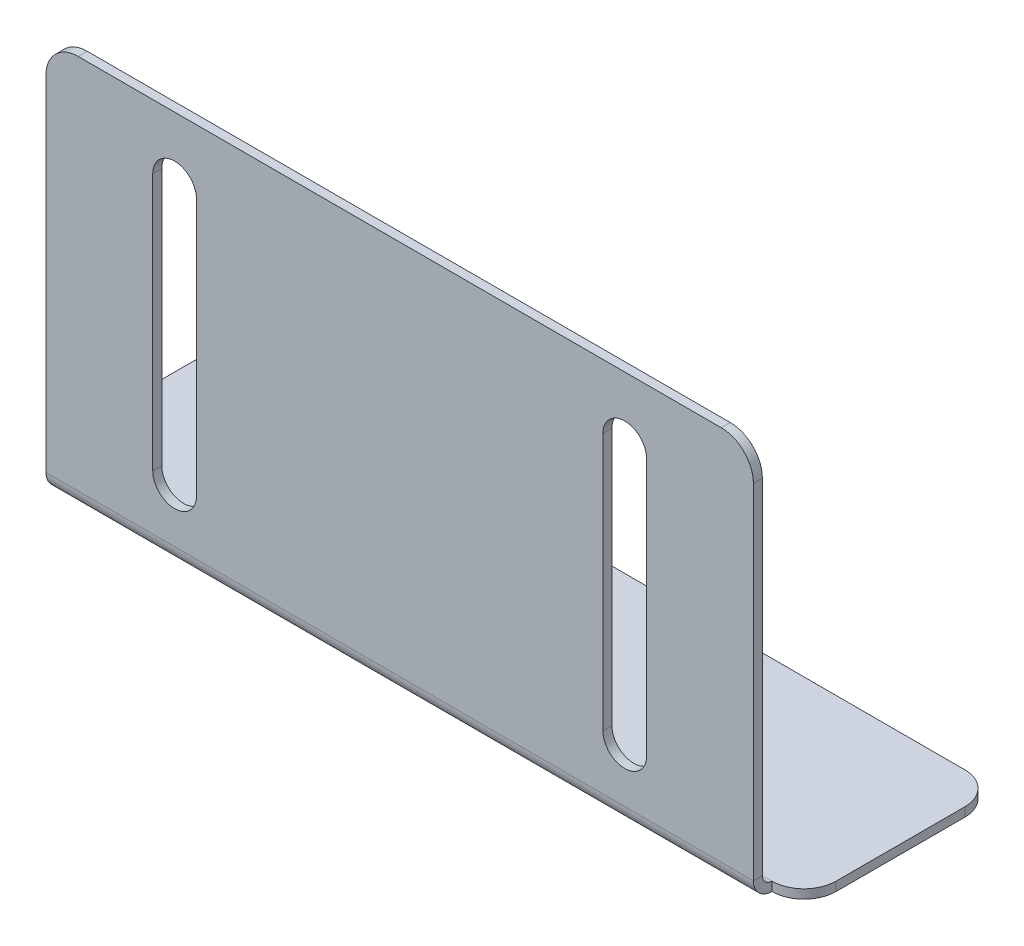
ISO-10303-21;
HEADER;
FILE_DESCRIPTION(('STEP AP214'),'2;1');
FILE_NAME('part.step','',(''),(''),'','','');
FILE_SCHEMA(('AUTOMOTIVE_DESIGN { 1 0 10303 214 1 1 1 1 }'));
ENDSEC;
DATA;
#1=APPLICATION_CONTEXT('core data for automotive mechanical design processes');
#2=APPLICATION_PROTOCOL_DEFINITION('international standard','automotive_design',2000,#1);
#3=PRODUCT_CONTEXT('',#1,'mechanical');
#4=PRODUCT('Part','Part','',(#3));
#5=PRODUCT_RELATED_PRODUCT_CATEGORY('part','',(#4));
#6=PRODUCT_DEFINITION_FORMATION('','',#4);
#7=PRODUCT_DEFINITION_CONTEXT('part definition',#1,'design');
#8=PRODUCT_DEFINITION('design','',#6,#7);
#9=PRODUCT_DEFINITION_SHAPE('','',#8);
#10=(LENGTH_UNIT() NAMED_UNIT(*) SI_UNIT(.MILLI.,.METRE.));
#11=(NAMED_UNIT(*) PLANE_ANGLE_UNIT() SI_UNIT($,.RADIAN.));
#12=(NAMED_UNIT(*) SI_UNIT($,.STERADIAN.) SOLID_ANGLE_UNIT());
#13=UNCERTAINTY_MEASURE_WITH_UNIT(LENGTH_MEASURE(1.E-05),#10,'distance_accuracy_value','');
#14=(GEOMETRIC_REPRESENTATION_CONTEXT(3) GLOBAL_UNCERTAINTY_ASSIGNED_CONTEXT((#13)) GLOBAL_UNIT_ASSIGNED_CONTEXT((#10,
#11,#12)) REPRESENTATION_CONTEXT('',''));
#15=CARTESIAN_POINT('',(0.,0.,0.));
#16=DIRECTION('',(0.,0.,1.));
#17=DIRECTION('',(1.,0.,0.));
#18=AXIS2_PLACEMENT_3D('',#15,#16,#17);
#19=CARTESIAN_POINT('',(-30.,-0.7,7.5));
#20=DIRECTION('',(0.,0.,1.));
#21=DIRECTION('',(1.,0.,0.));
#22=AXIS2_PLACEMENT_3D('',#19,#20,#21);
#23=PLANE('',#22);
#24=DIRECTION('',(1.,0.,0.));
#25=VECTOR('',#24,1.);
#26=CARTESIAN_POINT('',(-30.,-0.7,7.5));
#27=LINE('',#26,#25);
#28=CARTESIAN_POINT('',(27.5,-0.7,7.5));
#29=VERTEX_POINT('',#28);
#30=CARTESIAN_POINT('',(27.501,-0.7,7.5));
#31=VERTEX_POINT('',#30);
#32=EDGE_CURVE('E361',#29,#31,#27,.T.);
#33=ORIENTED_EDGE('',*,*,#32,.T.);
#34=DIRECTION('',(0.,1.,0.));
#35=VECTOR('',#34,1.);
#36=CARTESIAN_POINT('',(27.501,-0.7,7.5));
#37=LINE('',#36,#35);
#38=CARTESIAN_POINT('',(27.501,0.,7.5));
#39=VERTEX_POINT('',#38);
#40=EDGE_CURVE('E342',#31,#39,#37,.T.);
#41=ORIENTED_EDGE('',*,*,#40,.T.);
#42=DIRECTION('',(1.,0.,0.));
#43=VECTOR('',#42,1.);
#44=CARTESIAN_POINT('',(-30.,0.,7.5));
#45=LINE('',#44,#43);
#46=CARTESIAN_POINT('',(27.5,0.,7.5));
#47=VERTEX_POINT('',#46);
#48=EDGE_CURVE('E351',#47,#39,#45,.T.);
#49=ORIENTED_EDGE('',*,*,#48,.F.);
#50=DIRECTION('',(0.,-1.,0.));
#51=VECTOR('',#50,1.);
#52=CARTESIAN_POINT('',(27.5,0.,7.5));
#53=LINE('',#52,#51);
#54=EDGE_CURVE('E309',#47,#29,#53,.T.);
#55=ORIENTED_EDGE('',*,*,#54,.T.);
#56=EDGE_LOOP('',(#33,#41,#49,#55));
#57=FACE_BOUND('',#56,.T.);
#58=ADVANCED_FACE('F54',(#57),#23,.T.);
#59=CARTESIAN_POINT('',(30.,-0.7,-7.5));
#60=DIRECTION('',(1.,0.,0.));
#61=DIRECTION('',(0.,0.,-1.));
#62=AXIS2_PLACEMENT_3D('',#59,#60,#61);
#63=PLANE('',#62);
#64=DIRECTION('',(0.,0.,-1.));
#65=VECTOR('',#64,1.);
#66=CARTESIAN_POINT('',(30.,0.,-7.5));
#67=LINE('',#66,#65);
#68=CARTESIAN_POINT('',(30.,0.,5.001));
#69=VERTEX_POINT('',#68);
#70=CARTESIAN_POINT('',(30.,0.,-5.001));
#71=VERTEX_POINT('',#70);
#72=EDGE_CURVE('E308',#69,#71,#67,.T.);
#73=ORIENTED_EDGE('',*,*,#72,.F.);
#74=DIRECTION('',(0.,1.,0.));
#75=VECTOR('',#74,1.);
#76=CARTESIAN_POINT('',(30.,-0.7,5.001));
#77=LINE('',#76,#75);
#78=CARTESIAN_POINT('',(30.,-0.7,5.001));
#79=VERTEX_POINT('',#78);
#80=EDGE_CURVE('E375',#69,#79,#77,.F.);
#81=ORIENTED_EDGE('',*,*,#80,.T.);
#82=DIRECTION('',(0.,0.,-1.));
#83=VECTOR('',#82,1.);
#84=CARTESIAN_POINT('',(30.,-0.7,-7.5));
#85=LINE('',#84,#83);
#86=CARTESIAN_POINT('',(30.,-0.7,-5.001));
#87=VERTEX_POINT('',#86);
#88=EDGE_CURVE('E350',#79,#87,#85,.T.);
#89=ORIENTED_EDGE('',*,*,#88,.T.);
#90=DIRECTION('',(0.,1.,0.));
#91=VECTOR('',#90,1.);
#92=CARTESIAN_POINT('',(30.,-0.7,-5.001));
#93=LINE('',#92,#91);
#94=EDGE_CURVE('E480',#87,#71,#93,.T.);
#95=ORIENTED_EDGE('',*,*,#94,.T.);
#96=EDGE_LOOP('',(#73,#81,#89,#95));
#97=FACE_BOUND('',#96,.T.);
#98=ADVANCED_FACE('F477',(#97),#63,.T.);
#99=CARTESIAN_POINT('',(-27.501,0.,7.5));
#100=VERTEX_POINT('',#99);
#101=CARTESIAN_POINT('',(-27.5,0.,7.5));
#102=VERTEX_POINT('',#101);
#103=EDGE_CURVE('E347',#100,#102,#45,.T.);
#104=ORIENTED_EDGE('',*,*,#103,.F.);
#105=DIRECTION('',(0.,1.,0.));
#106=VECTOR('',#105,1.);
#107=CARTESIAN_POINT('',(-27.501,-0.7,7.5));
#108=LINE('',#107,#106);
#109=CARTESIAN_POINT('',(-27.501,-0.7,7.5));
#110=VERTEX_POINT('',#109);
#111=EDGE_CURVE('E390',#100,#110,#108,.F.);
#112=ORIENTED_EDGE('',*,*,#111,.T.);
#113=CARTESIAN_POINT('',(-27.5,-0.700000000000001,7.5));
#114=VERTEX_POINT('',#113);
#115=EDGE_CURVE('E346',#110,#114,#27,.T.);
#116=ORIENTED_EDGE('',*,*,#115,.T.);
#117=DIRECTION('',(0.,-1.,0.));
#118=VECTOR('',#117,1.);
#119=CARTESIAN_POINT('',(-27.5,0.,7.5));
#120=LINE('',#119,#118);
#121=EDGE_CURVE('E304',#102,#114,#120,.T.);
#122=ORIENTED_EDGE('',*,*,#121,.F.);
#123=EDGE_LOOP('',(#104,#112,#116,#122));
#124=FACE_BOUND('',#123,.T.);
#125=ADVANCED_FACE('F446',(#124),#23,.T.);
#126=CARTESIAN_POINT('',(-30.,-0.7,-7.5));
#127=DIRECTION('',(-1.,0.,0.));
#128=DIRECTION('',(0.,0.,1.));
#129=AXIS2_PLACEMENT_3D('',#126,#127,#128);
#130=PLANE('',#129);
#131=DIRECTION('',(0.,0.,1.));
#132=VECTOR('',#131,1.);
#133=CARTESIAN_POINT('',(-30.,-0.7,-7.5));
#134=LINE('',#133,#132);
#135=CARTESIAN_POINT('',(-30.,-0.7,-5.001));
#136=VERTEX_POINT('',#135);
#137=CARTESIAN_POINT('',(-30.,-0.7,5.001));
#138=VERTEX_POINT('',#137);
#139=EDGE_CURVE('E365',#136,#138,#134,.T.);
#140=ORIENTED_EDGE('',*,*,#139,.T.);
#141=DIRECTION('',(0.,1.,0.));
#142=VECTOR('',#141,1.);
#143=CARTESIAN_POINT('',(-30.,-0.7,5.001));
#144=LINE('',#143,#142);
#145=CARTESIAN_POINT('',(-30.,0.,5.001));
#146=VERTEX_POINT('',#145);
#147=EDGE_CURVE('E387',#138,#146,#144,.T.);
#148=ORIENTED_EDGE('',*,*,#147,.T.);
#149=DIRECTION('',(0.,0.,1.));
#150=VECTOR('',#149,1.);
#151=CARTESIAN_POINT('',(-30.,0.,-7.5));
#152=LINE('',#151,#150);
#153=CARTESIAN_POINT('',(-30.,0.,-5.001));
#154=VERTEX_POINT('',#153);
#155=EDGE_CURVE('E356',#154,#146,#152,.T.);
#156=ORIENTED_EDGE('',*,*,#155,.F.);
#157=DIRECTION('',(0.,1.,0.));
#158=VECTOR('',#157,1.);
#159=CARTESIAN_POINT('',(-30.,-0.7,-5.001));
#160=LINE('',#159,#158);
#161=EDGE_CURVE('E385',#154,#136,#160,.F.);
#162=ORIENTED_EDGE('',*,*,#161,.T.);
#163=EDGE_LOOP('',(#140,#148,#156,#162));
#164=FACE_BOUND('',#163,.T.);
#165=ADVANCED_FACE('F463',(#164),#130,.T.);
#166=CARTESIAN_POINT('',(-30.,-0.7,-7.5));
#167=DIRECTION('',(0.,0.,-1.));
#168=DIRECTION('',(-1.,0.,0.));
#169=AXIS2_PLACEMENT_3D('',#166,#167,#168);
#170=PLANE('',#169);
#171=DIRECTION('',(-1.,0.,0.));
#172=VECTOR('',#171,1.);
#173=CARTESIAN_POINT('',(-30.,-0.7,-7.5));
#174=LINE('',#173,#172);
#175=CARTESIAN_POINT('',(27.501,-0.7,-7.5));
#176=VERTEX_POINT('',#175);
#177=CARTESIAN_POINT('',(-27.501,-0.7,-7.5));
#178=VERTEX_POINT('',#177);
#179=EDGE_CURVE('E832',#176,#178,#174,.T.);
#180=ORIENTED_EDGE('',*,*,#179,.T.);
#181=DIRECTION('',(0.,1.,0.));
#182=VECTOR('',#181,1.);
#183=CARTESIAN_POINT('',(-27.501,-0.7,-7.5));
#184=LINE('',#183,#182);
#185=CARTESIAN_POINT('',(-27.501,0.,-7.5));
#186=VERTEX_POINT('',#185);
#187=EDGE_CURVE('E394',#178,#186,#184,.T.);
#188=ORIENTED_EDGE('',*,*,#187,.T.);
#189=DIRECTION('',(-1.,0.,0.));
#190=VECTOR('',#189,1.);
#191=CARTESIAN_POINT('',(-30.,0.,-7.5));
#192=LINE('',#191,#190);
#193=CARTESIAN_POINT('',(27.501,0.,-7.5));
#194=VERTEX_POINT('',#193);
#195=EDGE_CURVE('E469',#194,#186,#192,.T.);
#196=ORIENTED_EDGE('',*,*,#195,.F.);
#197=DIRECTION('',(0.,1.,0.));
#198=VECTOR('',#197,1.);
#199=CARTESIAN_POINT('',(27.501,-0.7,-7.5));
#200=LINE('',#199,#198);
#201=EDGE_CURVE('E392',#194,#176,#200,.F.);
#202=ORIENTED_EDGE('',*,*,#201,.T.);
#203=EDGE_LOOP('',(#180,#188,#196,#202));
#204=FACE_BOUND('',#203,.T.);
#205=ADVANCED_FACE('F522',(#204),#170,.T.);
#206=CARTESIAN_POINT('',(0.,-0.7,0.));
#207=DIRECTION('',(0.,1.,0.));
#208=DIRECTION('',(0.,0.,1.));
#209=AXIS2_PLACEMENT_3D('',#206,#207,#208);
#210=PLANE('',#209);
#211=ORIENTED_EDGE('',*,*,#88,.F.);
#212=CARTESIAN_POINT('',(27.501,-0.7,5.001));
#213=DIRECTION('',(0.,1.,0.));
#214=DIRECTION('',(0.,0.,1.));
#215=AXIS2_PLACEMENT_3D('',#212,#213,#214);
#216=CIRCLE('',#215,2.499);
#217=EDGE_CURVE('E383',#79,#31,#216,.F.);
#218=ORIENTED_EDGE('',*,*,#217,.T.);
#219=ORIENTED_EDGE('',*,*,#32,.F.);
#220=DIRECTION('',(1.,0.,0.));
#221=VECTOR('',#220,1.);
#222=CARTESIAN_POINT('',(27.5,-0.699999999999993,7.5));
#223=LINE('',#222,#221);
#224=EDGE_CURVE('E322',#29,#114,#223,.F.);
#225=ORIENTED_EDGE('',*,*,#224,.T.);
#226=ORIENTED_EDGE('',*,*,#115,.F.);
#227=CARTESIAN_POINT('',(-27.501,-0.7,5.001));
#228=DIRECTION('',(0.,1.,0.));
#229=DIRECTION('',(0.,0.,1.));
#230=AXIS2_PLACEMENT_3D('',#227,#228,#229);
#231=CIRCLE('',#230,2.499);
#232=EDGE_CURVE('E381',#110,#138,#231,.F.);
#233=ORIENTED_EDGE('',*,*,#232,.T.);
#234=ORIENTED_EDGE('',*,*,#139,.F.);
#235=CARTESIAN_POINT('',(-27.501,-0.7,-5.001));
#236=DIRECTION('',(0.,1.,0.));
#237=DIRECTION('',(0.,0.,1.));
#238=AXIS2_PLACEMENT_3D('',#235,#236,#237);
#239=CIRCLE('',#238,2.499);
#240=EDGE_CURVE('E379',#136,#178,#239,.F.);
#241=ORIENTED_EDGE('',*,*,#240,.T.);
#242=ORIENTED_EDGE('',*,*,#179,.F.);
#243=CARTESIAN_POINT('',(27.501,-0.7,-5.001));
#244=DIRECTION('',(0.,1.,0.));
#245=DIRECTION('',(0.,0.,1.));
#246=AXIS2_PLACEMENT_3D('',#243,#244,#245);
#247=CIRCLE('',#246,2.499);
#248=EDGE_CURVE('E377',#176,#87,#247,.F.);
#249=ORIENTED_EDGE('',*,*,#248,.T.);
#250=EDGE_LOOP('',(#211,#218,#219,#225,#226,#233,#234,#241,#242,#249));
#251=FACE_BOUND('',#250,.T.);
#252=ADVANCED_FACE('F452',(#251),#210,.F.);
#253=CARTESIAN_POINT('',(0.,0.,0.));
#254=DIRECTION('',(0.,1.,0.));
#255=DIRECTION('',(0.,0.,1.));
#256=AXIS2_PLACEMENT_3D('',#253,#254,#255);
#257=PLANE('',#256);
#258=ORIENTED_EDGE('',*,*,#48,.T.);
#259=CARTESIAN_POINT('',(27.501,0.,5.001));
#260=DIRECTION('',(0.,1.,0.));
#261=DIRECTION('',(0.,0.,1.));
#262=AXIS2_PLACEMENT_3D('',#259,#260,#261);
#263=CIRCLE('',#262,2.499);
#264=EDGE_CURVE('E473',#39,#69,#263,.T.);
#265=ORIENTED_EDGE('',*,*,#264,.T.);
#266=ORIENTED_EDGE('',*,*,#72,.T.);
#267=CARTESIAN_POINT('',(27.501,0.,-5.001));
#268=DIRECTION('',(0.,1.,0.));
#269=DIRECTION('',(0.,0.,1.));
#270=AXIS2_PLACEMENT_3D('',#267,#268,#269);
#271=CIRCLE('',#270,2.499);
#272=EDGE_CURVE('E345',#71,#194,#271,.T.);
#273=ORIENTED_EDGE('',*,*,#272,.T.);
#274=ORIENTED_EDGE('',*,*,#195,.T.);
#275=CARTESIAN_POINT('',(-27.501,0.,-5.001));
#276=DIRECTION('',(0.,1.,0.));
#277=DIRECTION('',(0.,0.,1.));
#278=AXIS2_PLACEMENT_3D('',#275,#276,#277);
#279=CIRCLE('',#278,2.499);
#280=EDGE_CURVE('E468',#186,#154,#279,.T.);
#281=ORIENTED_EDGE('',*,*,#280,.T.);
#282=ORIENTED_EDGE('',*,*,#155,.T.);
#283=CARTESIAN_POINT('',(-27.501,0.,5.001));
#284=DIRECTION('',(0.,1.,0.));
#285=DIRECTION('',(0.,0.,1.));
#286=AXIS2_PLACEMENT_3D('',#283,#284,#285);
#287=CIRCLE('',#286,2.499);
#288=EDGE_CURVE('E459',#146,#100,#287,.T.);
#289=ORIENTED_EDGE('',*,*,#288,.T.);
#290=ORIENTED_EDGE('',*,*,#103,.T.);
#291=DIRECTION('',(1.,0.,0.));
#292=VECTOR('',#291,1.);
#293=CARTESIAN_POINT('',(27.5,0.,7.5));
#294=LINE('',#293,#292);
#295=EDGE_CURVE('E316',#47,#102,#294,.F.);
#296=ORIENTED_EDGE('',*,*,#295,.F.);
#297=EDGE_LOOP('',(#258,#265,#266,#273,#274,#281,#282,#289,#290,#296));
#298=FACE_BOUND('',#297,.T.);
#299=ADVANCED_FACE('F466',(#298),#257,.T.);
#300=CARTESIAN_POINT('',(-27.5,0.736599999999995,7.5));
#301=DIRECTION('',(-1.,0.,0.));
#302=DIRECTION('',(0.,-1.,0.));
#303=AXIS2_PLACEMENT_3D('',#300,#301,#302);
#304=PLANE('',#303);
#305=DIRECTION('',(0.,0.,-1.));
#306=VECTOR('',#305,1.);
#307=CARTESIAN_POINT('',(-27.5,0.736599999999997,8.9366));
#308=LINE('',#307,#306);
#309=CARTESIAN_POINT('',(-27.5,0.736599999999995,8.2366));
#310=VERTEX_POINT('',#309);
#311=CARTESIAN_POINT('',(-27.5,0.736599999999995,8.9366));
#312=VERTEX_POINT('',#311);
#313=EDGE_CURVE('E295',#310,#312,#308,.F.);
#314=ORIENTED_EDGE('',*,*,#313,.F.);
#315=CARTESIAN_POINT('',(-27.5,0.736599999999995,7.5));
#316=DIRECTION('',(1.,0.,0.));
#317=DIRECTION('',(0.,1.,0.));
#318=AXIS2_PLACEMENT_3D('',#315,#316,#317);
#319=CIRCLE('',#318,0.736599999999997);
#320=EDGE_CURVE('E312',#102,#310,#319,.F.);
#321=ORIENTED_EDGE('',*,*,#320,.F.);
#322=ORIENTED_EDGE('',*,*,#121,.T.);
#323=CARTESIAN_POINT('',(-27.5,0.736599999999995,7.5));
#324=DIRECTION('',(1.,0.,0.));
#325=DIRECTION('',(0.,1.,0.));
#326=AXIS2_PLACEMENT_3D('',#323,#324,#325);
#327=CIRCLE('',#326,1.4366);
#328=EDGE_CURVE('E319',#114,#312,#327,.F.);
#329=ORIENTED_EDGE('',*,*,#328,.T.);
#330=EDGE_LOOP('',(#314,#321,#322,#329));
#331=FACE_BOUND('',#330,.T.);
#332=ADVANCED_FACE('F441',(#331),#304,.T.);
#333=CARTESIAN_POINT('',(27.5,0.736600000000004,7.5));
#334=DIRECTION('',(-1.,0.,0.));
#335=DIRECTION('',(0.,-1.,0.));
#336=AXIS2_PLACEMENT_3D('',#333,#334,#335);
#337=PLANE('',#336);
#338=CARTESIAN_POINT('',(27.5,0.736600000000004,7.5));
#339=DIRECTION('',(1.,0.,0.));
#340=DIRECTION('',(0.,1.,0.));
#341=AXIS2_PLACEMENT_3D('',#338,#339,#340);
#342=CIRCLE('',#341,0.736599999999997);
#343=CARTESIAN_POINT('',(27.5,0.736600000000004,8.2366));
#344=VERTEX_POINT('',#343);
#345=EDGE_CURVE('E276',#344,#47,#342,.T.);
#346=ORIENTED_EDGE('',*,*,#345,.F.);
#347=DIRECTION('',(0.,0.,-1.));
#348=VECTOR('',#347,1.);
#349=CARTESIAN_POINT('',(27.5,0.736600000000002,8.2366));
#350=LINE('',#349,#348);
#351=CARTESIAN_POINT('',(27.5,0.736600000000002,8.9366));
#352=VERTEX_POINT('',#351);
#353=EDGE_CURVE('E290',#344,#352,#350,.F.);
#354=ORIENTED_EDGE('',*,*,#353,.T.);
#355=CARTESIAN_POINT('',(27.5,0.736600000000004,7.5));
#356=DIRECTION('',(1.,0.,0.));
#357=DIRECTION('',(0.,1.,0.));
#358=AXIS2_PLACEMENT_3D('',#355,#356,#357);
#359=CIRCLE('',#358,1.4366);
#360=EDGE_CURVE('E315',#352,#29,#359,.T.);
#361=ORIENTED_EDGE('',*,*,#360,.T.);
#362=ORIENTED_EDGE('',*,*,#54,.F.);
#363=EDGE_LOOP('',(#346,#354,#361,#362));
#364=FACE_BOUND('',#363,.T.);
#365=ADVANCED_FACE('F433',(#364),#337,.F.);
#366=CARTESIAN_POINT('',(27.5,0.736600000000004,7.5));
#367=DIRECTION('',(1.,0.,0.));
#368=DIRECTION('',(0.,0.,1.));
#369=AXIS2_PLACEMENT_3D('',#366,#367,#368);
#370=CYLINDRICAL_SURFACE('',#369,1.4366);
#371=ORIENTED_EDGE('',*,*,#224,.F.);
#372=ORIENTED_EDGE('',*,*,#360,.F.);
#373=DIRECTION('',(1.,0.,0.));
#374=VECTOR('',#373,1.);
#375=CARTESIAN_POINT('',(-27.5,0.736599999999997,8.9366));
#376=LINE('',#375,#374);
#377=EDGE_CURVE('E287',#352,#312,#376,.F.);
#378=ORIENTED_EDGE('',*,*,#377,.T.);
#379=ORIENTED_EDGE('',*,*,#328,.F.);
#380=EDGE_LOOP('',(#371,#372,#378,#379));
#381=FACE_BOUND('',#380,.T.);
#382=ADVANCED_FACE('F438',(#381),#370,.T.);
#383=CARTESIAN_POINT('',(27.5,0.736600000000004,7.5));
#384=DIRECTION('',(1.,0.,0.));
#385=DIRECTION('',(0.,0.,1.));
#386=AXIS2_PLACEMENT_3D('',#383,#384,#385);
#387=CYLINDRICAL_SURFACE('',#386,0.736599999999997);
#388=ORIENTED_EDGE('',*,*,#295,.T.);
#389=ORIENTED_EDGE('',*,*,#320,.T.);
#390=DIRECTION('',(1.,0.,0.));
#391=VECTOR('',#390,1.);
#392=CARTESIAN_POINT('',(-27.5,0.736599999999997,8.2366));
#393=LINE('',#392,#391);
#394=EDGE_CURVE('E293',#310,#344,#393,.T.);
#395=ORIENTED_EDGE('',*,*,#394,.T.);
#396=ORIENTED_EDGE('',*,*,#345,.T.);
#397=EDGE_LOOP('',(#388,#389,#395,#396));
#398=FACE_BOUND('',#397,.T.);
#399=ADVANCED_FACE('F500',(#398),#387,.F.);
#400=CARTESIAN_POINT('',(-27.5,0.,8.9366));
#401=DIRECTION('',(1.,0.,0.));
#402=DIRECTION('',(0.,0.,-1.));
#403=AXIS2_PLACEMENT_3D('',#400,#401,#402);
#404=PLANE('',#403);
#405=DIRECTION('',(0.,-1.,0.));
#406=VECTOR('',#405,1.);
#407=CARTESIAN_POINT('',(-27.5,0.,8.9366));
#408=LINE('',#407,#406);
#409=CARTESIAN_POINT('',(-27.5,27.501,8.9366));
#410=VERTEX_POINT('',#409);
#411=EDGE_CURVE('E279',#410,#312,#408,.T.);
#412=ORIENTED_EDGE('',*,*,#411,.F.);
#413=DIRECTION('',(0.,0.,-1.));
#414=VECTOR('',#413,1.);
#415=CARTESIAN_POINT('',(-27.5,27.501,8.9366));
#416=LINE('',#415,#414);
#417=CARTESIAN_POINT('',(-27.5,27.501,8.2366));
#418=VERTEX_POINT('',#417);
#419=EDGE_CURVE('E397',#410,#418,#416,.T.);
#420=ORIENTED_EDGE('',*,*,#419,.T.);
#421=DIRECTION('',(0.,1.,0.));
#422=VECTOR('',#421,1.);
#423=CARTESIAN_POINT('',(-27.5,0.,8.2366));
#424=LINE('',#423,#422);
#425=EDGE_CURVE('E285',#418,#310,#424,.F.);
#426=ORIENTED_EDGE('',*,*,#425,.T.);
#427=ORIENTED_EDGE('',*,*,#313,.T.);
#428=EDGE_LOOP('',(#412,#420,#426,#427));
#429=FACE_BOUND('',#428,.T.);
#430=ADVANCED_FACE('F417',(#429),#404,.F.);
#431=CARTESIAN_POINT('',(27.5,30.,8.9366));
#432=DIRECTION('',(-1.,0.,0.));
#433=DIRECTION('',(0.,-1.,0.));
#434=AXIS2_PLACEMENT_3D('',#431,#432,#433);
#435=PLANE('',#434);
#436=DIRECTION('',(0.,-1.,0.));
#437=VECTOR('',#436,1.);
#438=CARTESIAN_POINT('',(27.5,30.,8.2366));
#439=LINE('',#438,#437);
#440=CARTESIAN_POINT('',(27.5,27.501,8.2366));
#441=VERTEX_POINT('',#440);
#442=EDGE_CURVE('E283',#344,#441,#439,.F.);
#443=ORIENTED_EDGE('',*,*,#442,.T.);
#444=DIRECTION('',(0.,0.,-1.));
#445=VECTOR('',#444,1.);
#446=CARTESIAN_POINT('',(27.5,27.501,8.9366));
#447=LINE('',#446,#445);
#448=CARTESIAN_POINT('',(27.5,27.501,8.9366));
#449=VERTEX_POINT('',#448);
#450=EDGE_CURVE('E13',#441,#449,#447,.F.);
#451=ORIENTED_EDGE('',*,*,#450,.T.);
#452=DIRECTION('',(0.,1.,0.));
#453=VECTOR('',#452,1.);
#454=CARTESIAN_POINT('',(27.5,0.,8.9366));
#455=LINE('',#454,#453);
#456=EDGE_CURVE('E277',#352,#449,#455,.T.);
#457=ORIENTED_EDGE('',*,*,#456,.F.);
#458=ORIENTED_EDGE('',*,*,#353,.F.);
#459=EDGE_LOOP('',(#443,#451,#457,#458));
#460=FACE_BOUND('',#459,.T.);
#461=ADVANCED_FACE('F430',(#460),#435,.F.);
#462=CARTESIAN_POINT('',(0.,0.,8.9366));
#463=DIRECTION('',(0.,0.,-1.));
#464=DIRECTION('',(-1.,0.,0.));
#465=AXIS2_PLACEMENT_3D('',#462,#463,#464);
#466=PLANE('',#465);
#467=DIRECTION('',(0.,1.,0.));
#468=VECTOR('',#467,1.);
#469=CARTESIAN_POINT('',(-19.2,0.,8.9366));
#470=LINE('',#469,#468);
#471=CARTESIAN_POINT('',(-19.2,5.,8.9366));
#472=VERTEX_POINT('',#471);
#473=CARTESIAN_POINT('',(-19.2,25.,8.9366));
#474=VERTEX_POINT('',#473);
#475=EDGE_CURVE('E337',#472,#474,#470,.T.);
#476=ORIENTED_EDGE('',*,*,#475,.T.);
#477=CARTESIAN_POINT('',(-17.5,25.,8.9366));
#478=DIRECTION('',(0.,0.,-1.));
#479=DIRECTION('',(-1.,0.,0.));
#480=AXIS2_PLACEMENT_3D('',#477,#478,#479);
#481=CIRCLE('',#480,1.7);
#482=CARTESIAN_POINT('',(-15.8,25.,8.9366));
#483=VERTEX_POINT('',#482);
#484=EDGE_CURVE('E255',#474,#483,#481,.T.);
#485=ORIENTED_EDGE('',*,*,#484,.T.);
#486=DIRECTION('',(0.,1.,0.));
#487=VECTOR('',#486,1.);
#488=CARTESIAN_POINT('',(-15.8,0.,8.9366));
#489=LINE('',#488,#487);
#490=CARTESIAN_POINT('',(-15.8,5.,8.9366));
#491=VERTEX_POINT('',#490);
#492=EDGE_CURVE('E251',#483,#491,#489,.F.);
#493=ORIENTED_EDGE('',*,*,#492,.T.);
#494=CARTESIAN_POINT('',(-17.5,5.,8.9366));
#495=DIRECTION('',(0.,0.,-1.));
#496=DIRECTION('',(-1.,0.,0.));
#497=AXIS2_PLACEMENT_3D('',#494,#495,#496);
#498=CIRCLE('',#497,1.7);
#499=EDGE_CURVE('E224',#491,#472,#498,.T.);
#500=ORIENTED_EDGE('',*,*,#499,.T.);
#501=EDGE_LOOP('',(#476,#485,#493,#500));
#502=FACE_BOUND('',#501,.T.);
#503=DIRECTION('',(0.,1.,0.));
#504=VECTOR('',#503,1.);
#505=CARTESIAN_POINT('',(15.8,0.,8.9366));
#506=LINE('',#505,#504);
#507=CARTESIAN_POINT('',(15.8,5.,8.9366));
#508=VERTEX_POINT('',#507);
#509=CARTESIAN_POINT('',(15.8,25.,8.9366));
#510=VERTEX_POINT('',#509);
#511=EDGE_CURVE('E330',#508,#510,#506,.T.);
#512=ORIENTED_EDGE('',*,*,#511,.T.);
#513=CARTESIAN_POINT('',(17.5,25.,8.9366));
#514=DIRECTION('',(0.,0.,-1.));
#515=DIRECTION('',(-1.,0.,0.));
#516=AXIS2_PLACEMENT_3D('',#513,#514,#515);
#517=CIRCLE('',#516,1.7);
#518=CARTESIAN_POINT('',(19.2,25.,8.9366));
#519=VERTEX_POINT('',#518);
#520=EDGE_CURVE('E298',#510,#519,#517,.T.);
#521=ORIENTED_EDGE('',*,*,#520,.T.);
#522=DIRECTION('',(0.,1.,0.));
#523=VECTOR('',#522,1.);
#524=CARTESIAN_POINT('',(19.2,0.,8.9366));
#525=LINE('',#524,#523);
#526=CARTESIAN_POINT('',(19.2,5.,8.9366));
#527=VERTEX_POINT('',#526);
#528=EDGE_CURVE('E273',#519,#527,#525,.F.);
#529=ORIENTED_EDGE('',*,*,#528,.T.);
#530=CARTESIAN_POINT('',(17.5,5.,8.9366));
#531=DIRECTION('',(0.,0.,-1.));
#532=DIRECTION('',(-1.,0.,0.));
#533=AXIS2_PLACEMENT_3D('',#530,#531,#532);
#534=CIRCLE('',#533,1.70000000000001);
#535=EDGE_CURVE('E327',#527,#508,#534,.T.);
#536=ORIENTED_EDGE('',*,*,#535,.T.);
#537=EDGE_LOOP('',(#512,#521,#529,#536));
#538=FACE_BOUND('',#537,.T.);
#539=DIRECTION('',(-1.,0.,0.));
#540=VECTOR('',#539,1.);
#541=CARTESIAN_POINT('',(0.,30.,8.9366));
#542=LINE('',#541,#540);
#543=CARTESIAN_POINT('',(25.001,30.,8.9366));
#544=VERTEX_POINT('',#543);
#545=CARTESIAN_POINT('',(-25.001,30.,8.9366));
#546=VERTEX_POINT('',#545);
#547=EDGE_CURVE('E274',#544,#546,#542,.T.);
#548=ORIENTED_EDGE('',*,*,#547,.T.);
#549=CARTESIAN_POINT('',(-25.001,27.501,8.9366));
#550=DIRECTION('',(0.,0.,-1.));
#551=DIRECTION('',(-1.,0.,0.));
#552=AXIS2_PLACEMENT_3D('',#549,#550,#551);
#553=CIRCLE('',#552,2.499);
#554=EDGE_CURVE('E62',#546,#410,#553,.F.);
#555=ORIENTED_EDGE('',*,*,#554,.T.);
#556=ORIENTED_EDGE('',*,*,#411,.T.);
#557=ORIENTED_EDGE('',*,*,#377,.F.);
#558=ORIENTED_EDGE('',*,*,#456,.T.);
#559=CARTESIAN_POINT('',(25.001,27.501,8.9366));
#560=DIRECTION('',(0.,0.,-1.));
#561=DIRECTION('',(-1.,0.,0.));
#562=AXIS2_PLACEMENT_3D('',#559,#560,#561);
#563=CIRCLE('',#562,2.499);
#564=EDGE_CURVE('E408',#449,#544,#563,.F.);
#565=ORIENTED_EDGE('',*,*,#564,.T.);
#566=EDGE_LOOP('',(#548,#555,#556,#557,#558,#565));
#567=FACE_BOUND('',#566,.T.);
#568=ADVANCED_FACE('F412',(#502,#538,#567),#466,.F.);
#569=CARTESIAN_POINT('',(0.,0.,8.2366));
#570=DIRECTION('',(0.,0.,-1.));
#571=DIRECTION('',(-1.,0.,0.));
#572=AXIS2_PLACEMENT_3D('',#569,#570,#571);
#573=PLANE('',#572);
#574=CARTESIAN_POINT('',(-17.5,25.,8.2366));
#575=DIRECTION('',(0.,0.,-1.));
#576=DIRECTION('',(-1.,0.,0.));
#577=AXIS2_PLACEMENT_3D('',#574,#575,#576);
#578=CIRCLE('',#577,1.7);
#579=CARTESIAN_POINT('',(-19.2,25.,8.2366));
#580=VERTEX_POINT('',#579);
#581=CARTESIAN_POINT('',(-15.8,25.,8.2366));
#582=VERTEX_POINT('',#581);
#583=EDGE_CURVE('E237',#580,#582,#578,.T.);
#584=ORIENTED_EDGE('',*,*,#583,.F.);
#585=DIRECTION('',(0.,1.,0.));
#586=VECTOR('',#585,1.);
#587=CARTESIAN_POINT('',(-19.2,25.,8.2366));
#588=LINE('',#587,#586);
#589=CARTESIAN_POINT('',(-19.2,5.,8.2366));
#590=VERTEX_POINT('',#589);
#591=EDGE_CURVE('E242',#590,#580,#588,.T.);
#592=ORIENTED_EDGE('',*,*,#591,.F.);
#593=CARTESIAN_POINT('',(-17.5,5.,8.2366));
#594=DIRECTION('',(0.,0.,-1.));
#595=DIRECTION('',(-1.,0.,0.));
#596=AXIS2_PLACEMENT_3D('',#593,#594,#595);
#597=CIRCLE('',#596,1.7);
#598=CARTESIAN_POINT('',(-15.8,5.,8.2366));
#599=VERTEX_POINT('',#598);
#600=EDGE_CURVE('E221',#599,#590,#597,.T.);
#601=ORIENTED_EDGE('',*,*,#600,.F.);
#602=DIRECTION('',(0.,-1.,0.));
#603=VECTOR('',#602,1.);
#604=CARTESIAN_POINT('',(-15.8,25.,8.2366));
#605=LINE('',#604,#603);
#606=EDGE_CURVE('E233',#582,#599,#605,.T.);
#607=ORIENTED_EDGE('',*,*,#606,.F.);
#608=EDGE_LOOP('',(#584,#592,#601,#607));
#609=FACE_BOUND('',#608,.T.);
#610=CARTESIAN_POINT('',(17.5,25.,8.2366));
#611=DIRECTION('',(0.,0.,-1.));
#612=DIRECTION('',(-1.,0.,0.));
#613=AXIS2_PLACEMENT_3D('',#610,#611,#612);
#614=CIRCLE('',#613,1.7);
#615=CARTESIAN_POINT('',(15.8,25.,8.2366));
#616=VERTEX_POINT('',#615);
#617=CARTESIAN_POINT('',(19.2,25.,8.2366));
#618=VERTEX_POINT('',#617);
#619=EDGE_CURVE('E252',#616,#618,#614,.T.);
#620=ORIENTED_EDGE('',*,*,#619,.F.);
#621=DIRECTION('',(0.,1.,0.));
#622=VECTOR('',#621,1.);
#623=CARTESIAN_POINT('',(15.8,25.,8.2366));
#624=LINE('',#623,#622);
#625=CARTESIAN_POINT('',(15.8,5.,8.2366));
#626=VERTEX_POINT('',#625);
#627=EDGE_CURVE('E261',#626,#616,#624,.T.);
#628=ORIENTED_EDGE('',*,*,#627,.F.);
#629=CARTESIAN_POINT('',(17.5,5.,8.2366));
#630=DIRECTION('',(0.,0.,-1.));
#631=DIRECTION('',(-1.,0.,0.));
#632=AXIS2_PLACEMENT_3D('',#629,#630,#631);
#633=CIRCLE('',#632,1.70000000000001);
#634=CARTESIAN_POINT('',(19.2,5.,8.2366));
#635=VERTEX_POINT('',#634);
#636=EDGE_CURVE('E258',#635,#626,#633,.T.);
#637=ORIENTED_EDGE('',*,*,#636,.F.);
#638=DIRECTION('',(0.,-1.,0.));
#639=VECTOR('',#638,1.);
#640=CARTESIAN_POINT('',(19.2,25.,8.2366));
#641=LINE('',#640,#639);
#642=EDGE_CURVE('E254',#618,#635,#641,.T.);
#643=ORIENTED_EDGE('',*,*,#642,.F.);
#644=EDGE_LOOP('',(#620,#628,#637,#643));
#645=FACE_BOUND('',#644,.T.);
#646=ORIENTED_EDGE('',*,*,#425,.F.);
#647=CARTESIAN_POINT('',(-25.001,27.501,8.2366));
#648=DIRECTION('',(0.,0.,-1.));
#649=DIRECTION('',(-1.,0.,0.));
#650=AXIS2_PLACEMENT_3D('',#647,#648,#649);
#651=CIRCLE('',#650,2.499);
#652=CARTESIAN_POINT('',(-25.001,30.,8.2366));
#653=VERTEX_POINT('',#652);
#654=EDGE_CURVE('E402',#418,#653,#651,.T.);
#655=ORIENTED_EDGE('',*,*,#654,.T.);
#656=DIRECTION('',(1.,0.,0.));
#657=VECTOR('',#656,1.);
#658=CARTESIAN_POINT('',(-27.5,30.,8.2366));
#659=LINE('',#658,#657);
#660=CARTESIAN_POINT('',(25.001,30.,8.2366));
#661=VERTEX_POINT('',#660);
#662=EDGE_CURVE('E281',#661,#653,#659,.F.);
#663=ORIENTED_EDGE('',*,*,#662,.F.);
#664=CARTESIAN_POINT('',(25.001,27.501,8.2366));
#665=DIRECTION('',(0.,0.,-1.));
#666=DIRECTION('',(-1.,0.,0.));
#667=AXIS2_PLACEMENT_3D('',#664,#665,#666);
#668=CIRCLE('',#667,2.499);
#669=EDGE_CURVE('E400',#661,#441,#668,.T.);
#670=ORIENTED_EDGE('',*,*,#669,.T.);
#671=ORIENTED_EDGE('',*,*,#442,.F.);
#672=ORIENTED_EDGE('',*,*,#394,.F.);
#673=EDGE_LOOP('',(#646,#655,#663,#670,#671,#672));
#674=FACE_BOUND('',#673,.T.);
#675=ADVANCED_FACE('F239',(#609,#645,#674),#573,.T.);
#676=CARTESIAN_POINT('',(-27.5,30.,8.9366));
#677=DIRECTION('',(0.,-1.,0.));
#678=DIRECTION('',(0.,0.,-1.));
#679=AXIS2_PLACEMENT_3D('',#676,#677,#678);
#680=PLANE('',#679);
#681=ORIENTED_EDGE('',*,*,#662,.T.);
#682=DIRECTION('',(0.,0.,-1.));
#683=VECTOR('',#682,1.);
#684=CARTESIAN_POINT('',(-25.001,30.,8.9366));
#685=LINE('',#684,#683);
#686=EDGE_CURVE('E75',#653,#546,#685,.F.);
#687=ORIENTED_EDGE('',*,*,#686,.T.);
#688=ORIENTED_EDGE('',*,*,#547,.F.);
#689=DIRECTION('',(0.,0.,-1.));
#690=VECTOR('',#689,1.);
#691=CARTESIAN_POINT('',(25.001,30.,8.9366));
#692=LINE('',#691,#690);
#693=EDGE_CURVE('E404',#544,#661,#692,.T.);
#694=ORIENTED_EDGE('',*,*,#693,.T.);
#695=EDGE_LOOP('',(#681,#687,#688,#694));
#696=FACE_BOUND('',#695,.T.);
#697=ADVANCED_FACE('F424',(#696),#680,.F.);
#698=CARTESIAN_POINT('',(17.5,25.,8.936625));
#699=DIRECTION('',(0.,0.,-1.));
#700=DIRECTION('',(-1.,0.,0.));
#701=AXIS2_PLACEMENT_3D('',#698,#699,#700);
#702=CYLINDRICAL_SURFACE('',#701,1.7);
#703=DIRECTION('',(0.,0.,-1.));
#704=VECTOR('',#703,1.);
#705=CARTESIAN_POINT('',(15.8,25.,8.936625));
#706=LINE('',#705,#704);
#707=EDGE_CURVE('E271',#510,#616,#706,.T.);
#708=ORIENTED_EDGE('',*,*,#707,.T.);
#709=ORIENTED_EDGE('',*,*,#619,.T.);
#710=DIRECTION('',(0.,0.,-1.));
#711=VECTOR('',#710,1.);
#712=CARTESIAN_POINT('',(19.2,25.,8.936625));
#713=LINE('',#712,#711);
#714=EDGE_CURVE('E264',#519,#618,#713,.T.);
#715=ORIENTED_EDGE('',*,*,#714,.F.);
#716=ORIENTED_EDGE('',*,*,#520,.F.);
#717=EDGE_LOOP('',(#708,#709,#715,#716));
#718=FACE_BOUND('',#717,.T.);
#719=ADVANCED_FACE('F591',(#718),#702,.F.);
#720=CARTESIAN_POINT('',(15.8,25.,8.936625));
#721=DIRECTION('',(-1.,0.,0.));
#722=DIRECTION('',(0.,-1.,0.));
#723=AXIS2_PLACEMENT_3D('',#720,#721,#722);
#724=PLANE('',#723);
#725=DIRECTION('',(0.,0.,-1.));
#726=VECTOR('',#725,1.);
#727=CARTESIAN_POINT('',(15.8,5.,8.936625));
#728=LINE('',#727,#726);
#729=EDGE_CURVE('E267',#508,#626,#728,.T.);
#730=ORIENTED_EDGE('',*,*,#729,.T.);
#731=ORIENTED_EDGE('',*,*,#627,.T.);
#732=ORIENTED_EDGE('',*,*,#707,.F.);
#733=ORIENTED_EDGE('',*,*,#511,.F.);
#734=EDGE_LOOP('',(#730,#731,#732,#733));
#735=FACE_BOUND('',#734,.T.);
#736=ADVANCED_FACE('F736',(#735),#724,.F.);
#737=CARTESIAN_POINT('',(17.5,5.,8.936625));
#738=DIRECTION('',(0.,0.,-1.));
#739=DIRECTION('',(-1.,0.,0.));
#740=AXIS2_PLACEMENT_3D('',#737,#738,#739);
#741=CYLINDRICAL_SURFACE('',#740,1.70000000000001);
#742=DIRECTION('',(0.,0.,-1.));
#743=VECTOR('',#742,1.);
#744=CARTESIAN_POINT('',(19.2,5.,8.936625));
#745=LINE('',#744,#743);
#746=EDGE_CURVE('E265',#527,#635,#745,.T.);
#747=ORIENTED_EDGE('',*,*,#746,.T.);
#748=ORIENTED_EDGE('',*,*,#636,.T.);
#749=ORIENTED_EDGE('',*,*,#729,.F.);
#750=ORIENTED_EDGE('',*,*,#535,.F.);
#751=EDGE_LOOP('',(#747,#748,#749,#750));
#752=FACE_BOUND('',#751,.T.);
#753=ADVANCED_FACE('F725',(#752),#741,.F.);
#754=CARTESIAN_POINT('',(19.2,25.,8.936625));
#755=DIRECTION('',(1.,0.,0.));
#756=DIRECTION('',(0.,1.,0.));
#757=AXIS2_PLACEMENT_3D('',#754,#755,#756);
#758=PLANE('',#757);
#759=ORIENTED_EDGE('',*,*,#714,.T.);
#760=ORIENTED_EDGE('',*,*,#642,.T.);
#761=ORIENTED_EDGE('',*,*,#746,.F.);
#762=ORIENTED_EDGE('',*,*,#528,.F.);
#763=EDGE_LOOP('',(#759,#760,#761,#762));
#764=FACE_BOUND('',#763,.T.);
#765=ADVANCED_FACE('F714',(#764),#758,.F.);
#766=CARTESIAN_POINT('',(-17.5,25.,8.936625));
#767=DIRECTION('',(0.,0.,-1.));
#768=DIRECTION('',(-1.,0.,0.));
#769=AXIS2_PLACEMENT_3D('',#766,#767,#768);
#770=CYLINDRICAL_SURFACE('',#769,1.7);
#771=DIRECTION('',(0.,0.,-1.));
#772=VECTOR('',#771,1.);
#773=CARTESIAN_POINT('',(-19.2,25.,8.936625));
#774=LINE('',#773,#772);
#775=EDGE_CURVE('E249',#474,#580,#774,.T.);
#776=ORIENTED_EDGE('',*,*,#775,.T.);
#777=ORIENTED_EDGE('',*,*,#583,.T.);
#778=DIRECTION('',(0.,0.,-1.));
#779=VECTOR('',#778,1.);
#780=CARTESIAN_POINT('',(-15.8,25.,8.936625));
#781=LINE('',#780,#779);
#782=EDGE_CURVE('E229',#483,#582,#781,.T.);
#783=ORIENTED_EDGE('',*,*,#782,.F.);
#784=ORIENTED_EDGE('',*,*,#484,.F.);
#785=EDGE_LOOP('',(#776,#777,#783,#784));
#786=FACE_BOUND('',#785,.T.);
#787=ADVANCED_FACE('F703',(#786),#770,.F.);
#788=CARTESIAN_POINT('',(-19.2,25.,8.936625));
#789=DIRECTION('',(-1.,0.,0.));
#790=DIRECTION('',(0.,-1.,0.));
#791=AXIS2_PLACEMENT_3D('',#788,#789,#790);
#792=PLANE('',#791);
#793=DIRECTION('',(0.,0.,-1.));
#794=VECTOR('',#793,1.);
#795=CARTESIAN_POINT('',(-19.2,5.,8.936625));
#796=LINE('',#795,#794);
#797=EDGE_CURVE('E228',#472,#590,#796,.T.);
#798=ORIENTED_EDGE('',*,*,#797,.T.);
#799=ORIENTED_EDGE('',*,*,#591,.T.);
#800=ORIENTED_EDGE('',*,*,#775,.F.);
#801=ORIENTED_EDGE('',*,*,#475,.F.);
#802=EDGE_LOOP('',(#798,#799,#800,#801));
#803=FACE_BOUND('',#802,.T.);
#804=ADVANCED_FACE('F693',(#803),#792,.F.);
#805=CARTESIAN_POINT('',(-17.5,5.,8.936625));
#806=DIRECTION('',(0.,0.,-1.));
#807=DIRECTION('',(-1.,0.,0.));
#808=AXIS2_PLACEMENT_3D('',#805,#806,#807);
#809=CYLINDRICAL_SURFACE('',#808,1.7);
#810=DIRECTION('',(0.,0.,-1.));
#811=VECTOR('',#810,1.);
#812=CARTESIAN_POINT('',(-15.8,5.,8.936625));
#813=LINE('',#812,#811);
#814=EDGE_CURVE('E217',#491,#599,#813,.T.);
#815=ORIENTED_EDGE('',*,*,#814,.T.);
#816=ORIENTED_EDGE('',*,*,#600,.T.);
#817=ORIENTED_EDGE('',*,*,#797,.F.);
#818=ORIENTED_EDGE('',*,*,#499,.F.);
#819=EDGE_LOOP('',(#815,#816,#817,#818));
#820=FACE_BOUND('',#819,.T.);
#821=ADVANCED_FACE('F219',(#820),#809,.F.);
#822=CARTESIAN_POINT('',(-15.8,25.,8.936625));
#823=DIRECTION('',(1.,0.,0.));
#824=DIRECTION('',(0.,0.,-1.));
#825=AXIS2_PLACEMENT_3D('',#822,#823,#824);
#826=PLANE('',#825);
#827=ORIENTED_EDGE('',*,*,#782,.T.);
#828=ORIENTED_EDGE('',*,*,#606,.T.);
#829=ORIENTED_EDGE('',*,*,#814,.F.);
#830=ORIENTED_EDGE('',*,*,#492,.F.);
#831=EDGE_LOOP('',(#827,#828,#829,#830));
#832=FACE_BOUND('',#831,.T.);
#833=ADVANCED_FACE('F234',(#832),#826,.F.);
#834=CARTESIAN_POINT('',(27.501,-0.7,5.001));
#835=DIRECTION('',(0.,1.,0.));
#836=DIRECTION('',(0.,0.,1.));
#837=AXIS2_PLACEMENT_3D('',#834,#835,#836);
#838=CYLINDRICAL_SURFACE('',#837,2.499);
#839=ORIENTED_EDGE('',*,*,#217,.F.);
#840=ORIENTED_EDGE('',*,*,#80,.F.);
#841=ORIENTED_EDGE('',*,*,#264,.F.);
#842=ORIENTED_EDGE('',*,*,#40,.F.);
#843=EDGE_LOOP('',(#839,#840,#841,#842));
#844=FACE_BOUND('',#843,.T.);
#845=ADVANCED_FACE('F483',(#844),#838,.T.);
#846=CARTESIAN_POINT('',(-27.501,-0.7,5.001));
#847=DIRECTION('',(0.,1.,0.));
#848=DIRECTION('',(0.,0.,1.));
#849=AXIS2_PLACEMENT_3D('',#846,#847,#848);
#850=CYLINDRICAL_SURFACE('',#849,2.499);
#851=ORIENTED_EDGE('',*,*,#232,.F.);
#852=ORIENTED_EDGE('',*,*,#111,.F.);
#853=ORIENTED_EDGE('',*,*,#288,.F.);
#854=ORIENTED_EDGE('',*,*,#147,.F.);
#855=EDGE_LOOP('',(#851,#852,#853,#854));
#856=FACE_BOUND('',#855,.T.);
#857=ADVANCED_FACE('F458',(#856),#850,.T.);
#858=CARTESIAN_POINT('',(-27.501,-0.7,-5.001));
#859=DIRECTION('',(0.,1.,0.));
#860=DIRECTION('',(0.,0.,1.));
#861=AXIS2_PLACEMENT_3D('',#858,#859,#860);
#862=CYLINDRICAL_SURFACE('',#861,2.499);
#863=ORIENTED_EDGE('',*,*,#240,.F.);
#864=ORIENTED_EDGE('',*,*,#161,.F.);
#865=ORIENTED_EDGE('',*,*,#280,.F.);
#866=ORIENTED_EDGE('',*,*,#187,.F.);
#867=EDGE_LOOP('',(#863,#864,#865,#866));
#868=FACE_BOUND('',#867,.T.);
#869=ADVANCED_FACE('F533',(#868),#862,.T.);
#870=CARTESIAN_POINT('',(27.501,-0.7,-5.001));
#871=DIRECTION('',(0.,1.,0.));
#872=DIRECTION('',(0.,0.,1.));
#873=AXIS2_PLACEMENT_3D('',#870,#871,#872);
#874=CYLINDRICAL_SURFACE('',#873,2.499);
#875=ORIENTED_EDGE('',*,*,#248,.F.);
#876=ORIENTED_EDGE('',*,*,#201,.F.);
#877=ORIENTED_EDGE('',*,*,#272,.F.);
#878=ORIENTED_EDGE('',*,*,#94,.F.);
#879=EDGE_LOOP('',(#875,#876,#877,#878));
#880=FACE_BOUND('',#879,.T.);
#881=ADVANCED_FACE('F536',(#880),#874,.T.);
#882=CARTESIAN_POINT('',(-25.001,27.501,8.9366));
#883=DIRECTION('',(0.,0.,-1.));
#884=DIRECTION('',(-1.,0.,0.));
#885=AXIS2_PLACEMENT_3D('',#882,#883,#884);
#886=CYLINDRICAL_SURFACE('',#885,2.499);
#887=ORIENTED_EDGE('',*,*,#554,.F.);
#888=ORIENTED_EDGE('',*,*,#686,.F.);
#889=ORIENTED_EDGE('',*,*,#654,.F.);
#890=ORIENTED_EDGE('',*,*,#419,.F.);
#891=EDGE_LOOP('',(#887,#888,#889,#890));
#892=FACE_BOUND('',#891,.T.);
#893=ADVANCED_FACE('F420',(#892),#886,.T.);
#894=CARTESIAN_POINT('',(25.001,27.501,8.9366));
#895=DIRECTION('',(0.,0.,-1.));
#896=DIRECTION('',(-1.,0.,0.));
#897=AXIS2_PLACEMENT_3D('',#894,#895,#896);
#898=CYLINDRICAL_SURFACE('',#897,2.499);
#899=ORIENTED_EDGE('',*,*,#564,.F.);
#900=ORIENTED_EDGE('',*,*,#450,.F.);
#901=ORIENTED_EDGE('',*,*,#669,.F.);
#902=ORIENTED_EDGE('',*,*,#693,.F.);
#903=EDGE_LOOP('',(#899,#900,#901,#902));
#904=FACE_BOUND('',#903,.T.);
#905=ADVANCED_FACE('F56',(#904),#898,.T.);
#906=CLOSED_SHELL('',(#58,#98,#125,#165,#205,#252,#299,#332,#365,#382,#399,#430,#461,#568,#675,
#697,#719,#736,#753,#765,#787,#804,#821,#833,#845,#857,#869,#881,#893,#905));
#907=MANIFOLD_SOLID_BREP('B2',#906);
#908=ADVANCED_BREP_SHAPE_REPRESENTATION('',(#18,#907),#14);
#909=SHAPE_DEFINITION_REPRESENTATION(#9,#908);
ENDSEC;
END-ISO-10303-21;
